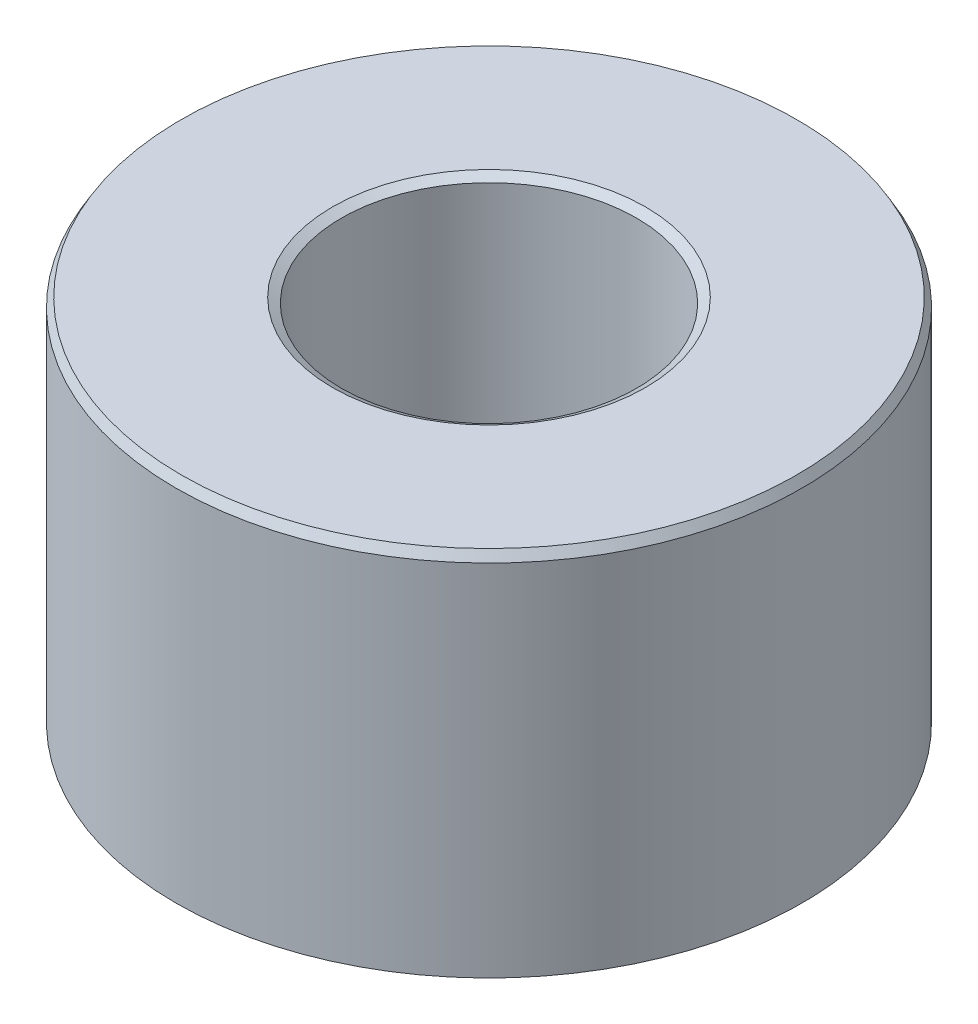
ISO-10303-21;
HEADER;
FILE_DESCRIPTION(('STEP AP214'),'2;1');
FILE_NAME('part.step','',(''),(''),'','','');
FILE_SCHEMA(('AUTOMOTIVE_DESIGN { 1 0 10303 214 1 1 1 1 }'));
ENDSEC;
DATA;
#1=APPLICATION_CONTEXT('core data for automotive mechanical design processes');
#2=APPLICATION_PROTOCOL_DEFINITION('international standard','automotive_design',2000,#1);
#3=PRODUCT_CONTEXT('',#1,'mechanical');
#4=PRODUCT('Part','Part','',(#3));
#5=PRODUCT_RELATED_PRODUCT_CATEGORY('part','',(#4));
#6=PRODUCT_DEFINITION_FORMATION('','',#4);
#7=PRODUCT_DEFINITION_CONTEXT('part definition',#1,'design');
#8=PRODUCT_DEFINITION('design','',#6,#7);
#9=PRODUCT_DEFINITION_SHAPE('','',#8);
#10=(LENGTH_UNIT() NAMED_UNIT(*) SI_UNIT(.MILLI.,.METRE.));
#11=(NAMED_UNIT(*) PLANE_ANGLE_UNIT() SI_UNIT($,.RADIAN.));
#12=(NAMED_UNIT(*) SI_UNIT($,.STERADIAN.) SOLID_ANGLE_UNIT());
#13=UNCERTAINTY_MEASURE_WITH_UNIT(LENGTH_MEASURE(1.E-05),#10,'distance_accuracy_value','');
#14=(GEOMETRIC_REPRESENTATION_CONTEXT(3) GLOBAL_UNCERTAINTY_ASSIGNED_CONTEXT((#13)) GLOBAL_UNIT_ASSIGNED_CONTEXT((#10,
#11,#12)) REPRESENTATION_CONTEXT('',''));
#15=CARTESIAN_POINT('',(0.,0.,0.));
#16=DIRECTION('',(0.,0.,1.));
#17=DIRECTION('',(1.,0.,0.));
#18=AXIS2_PLACEMENT_3D('',#15,#16,#17);
#19=CARTESIAN_POINT('',(0.,47.7332556404234,0.));
#20=DIRECTION('',(0.,-1.,0.));
#21=DIRECTION('',(0.,0.,-1.));
#22=AXIS2_PLACEMENT_3D('',#19,#20,#21);
#23=CYLINDRICAL_SURFACE('',#22,40.);
#24=CARTESIAN_POINT('',(0.,0.660036198186671,0.));
#25=DIRECTION('',(0.,1.,0.));
#26=DIRECTION('',(0.,0.,1.));
#27=AXIS2_PLACEMENT_3D('',#24,#25,#26);
#28=CIRCLE('',#27,40.);
#29=CARTESIAN_POINT('',(0.,0.660036198186671,40.));
#30=VERTEX_POINT('',#29);
#31=EDGE_CURVE('E10',#30,#30,#28,.T.);
#32=ORIENTED_EDGE('',*,*,#31,.T.);
#33=EDGE_LOOP('',(#32));
#34=FACE_BOUND('',#33,.T.);
#35=CARTESIAN_POINT('',(0.,46.5900394103295,0.));
#36=DIRECTION('',(0.,1.,0.));
#37=DIRECTION('',(0.,0.,1.));
#38=AXIS2_PLACEMENT_3D('',#35,#36,#37);
#39=CIRCLE('',#38,40.);
#40=CARTESIAN_POINT('',(0.,46.5900394103295,40.));
#41=VERTEX_POINT('',#40);
#42=EDGE_CURVE('E50',#41,#41,#39,.F.);
#43=ORIENTED_EDGE('',*,*,#42,.T.);
#44=EDGE_LOOP('',(#43));
#45=FACE_BOUND('',#44,.T.);
#46=ADVANCED_FACE('F39',(#34,#45),#23,.T.);
#47=CARTESIAN_POINT('',(0.,47.7332556404234,0.));
#48=DIRECTION('',(0.,1.,0.));
#49=DIRECTION('',(0.,0.,1.));
#50=AXIS2_PLACEMENT_3D('',#47,#48,#49);
#51=PLANE('',#50);
#52=CARTESIAN_POINT('',(0.,47.7332556404234,0.));
#53=DIRECTION('',(0.,1.,0.));
#54=DIRECTION('',(0.,0.,1.));
#55=AXIS2_PLACEMENT_3D('',#52,#53,#54);
#56=CIRCLE('',#55,20.00374684527);
#57=CARTESIAN_POINT('',(0.,47.7332556404234,20.00374684527));
#58=VERTEX_POINT('',#57);
#59=EDGE_CURVE('E58',#58,#58,#56,.F.);
#60=ORIENTED_EDGE('',*,*,#59,.T.);
#61=EDGE_LOOP('',(#60));
#62=FACE_BOUND('',#61,.T.);
#63=CARTESIAN_POINT('',(0.,47.7332556404234,0.));
#64=DIRECTION('',(0.,1.,0.));
#65=DIRECTION('',(0.,0.,1.));
#66=AXIS2_PLACEMENT_3D('',#63,#64,#65);
#67=CIRCLE('',#66,39.3399638018133);
#68=CARTESIAN_POINT('',(0.,47.7332556404234,39.3399638018133));
#69=VERTEX_POINT('',#68);
#70=EDGE_CURVE('E61',#69,#69,#67,.T.);
#71=ORIENTED_EDGE('',*,*,#70,.T.);
#72=EDGE_LOOP('',(#71));
#73=FACE_BOUND('',#72,.T.);
#74=ADVANCED_FACE('F88',(#62,#73),#51,.T.);
#75=CARTESIAN_POINT('',(0.,0.,0.));
#76=DIRECTION('',(0.,1.,0.));
#77=DIRECTION('',(0.,0.,1.));
#78=AXIS2_PLACEMENT_3D('',#75,#76,#77);
#79=PLANE('',#78);
#80=CARTESIAN_POINT('',(0.,0.,0.));
#81=DIRECTION('',(0.,1.,0.));
#82=DIRECTION('',(0.,0.,1.));
#83=AXIS2_PLACEMENT_3D('',#80,#81,#82);
#84=CIRCLE('',#83,19.5205668133627);
#85=CARTESIAN_POINT('',(0.,0.,19.5205668133627));
#86=VERTEX_POINT('',#85);
#87=EDGE_CURVE('E51',#86,#86,#84,.T.);
#88=ORIENTED_EDGE('',*,*,#87,.T.);
#89=EDGE_LOOP('',(#88));
#90=FACE_BOUND('',#89,.T.);
#91=CARTESIAN_POINT('',(0.,0.,0.));
#92=DIRECTION('',(0.,1.,0.));
#93=DIRECTION('',(0.,0.,1.));
#94=AXIS2_PLACEMENT_3D('',#91,#92,#93);
#95=CIRCLE('',#94,38.8567837699061);
#96=CARTESIAN_POINT('',(0.,0.,38.8567837699061));
#97=VERTEX_POINT('',#96);
#98=EDGE_CURVE('E54',#97,#97,#95,.F.);
#99=ORIENTED_EDGE('',*,*,#98,.T.);
#100=EDGE_LOOP('',(#99));
#101=FACE_BOUND('',#100,.T.);
#102=ADVANCED_FACE('F83',(#90,#101),#79,.F.);
#103=CARTESIAN_POINT('',(0.,47.7332556404234,0.));
#104=DIRECTION('',(0.,-1.,0.));
#105=DIRECTION('',(0.,0.,-1.));
#106=AXIS2_PLACEMENT_3D('',#103,#104,#105);
#107=CYLINDRICAL_SURFACE('',#106,18.8605306151761);
#108=CARTESIAN_POINT('',(0.,47.0732194422367,0.));
#109=DIRECTION('',(0.,1.,0.));
#110=DIRECTION('',(0.,0.,1.));
#111=AXIS2_PLACEMENT_3D('',#108,#109,#110);
#112=CIRCLE('',#111,18.8605306151761);
#113=CARTESIAN_POINT('',(0.,47.0732194422367,18.8605306151761));
#114=VERTEX_POINT('',#113);
#115=EDGE_CURVE('E67',#114,#114,#112,.T.);
#116=ORIENTED_EDGE('',*,*,#115,.T.);
#117=EDGE_LOOP('',(#116));
#118=FACE_BOUND('',#117,.T.);
#119=CARTESIAN_POINT('',(0.,1.14321623009394,0.));
#120=DIRECTION('',(0.,1.,0.));
#121=DIRECTION('',(0.,0.,1.));
#122=AXIS2_PLACEMENT_3D('',#119,#120,#121);
#123=CIRCLE('',#122,18.8605306151761);
#124=CARTESIAN_POINT('',(0.,1.14321623009394,18.8605306151761));
#125=VERTEX_POINT('',#124);
#126=EDGE_CURVE('E69',#125,#125,#123,.F.);
#127=ORIENTED_EDGE('',*,*,#126,.T.);
#128=EDGE_LOOP('',(#127));
#129=FACE_BOUND('',#128,.T.);
#130=ADVANCED_FACE('F71',(#118,#129),#107,.F.);
#131=CARTESIAN_POINT('',(0.,47.0732194422367,0.));
#132=DIRECTION('',(0.,1.,0.));
#133=DIRECTION('',(0.,0.,1.));
#134=AXIS2_PLACEMENT_3D('',#131,#132,#133);
#135=CONICAL_SURFACE('',#134,18.8605306151761,1.0471975511966);
#136=ORIENTED_EDGE('',*,*,#59,.F.);
#137=EDGE_LOOP('',(#136));
#138=FACE_BOUND('',#137,.T.);
#139=ORIENTED_EDGE('',*,*,#115,.F.);
#140=EDGE_LOOP('',(#139));
#141=FACE_BOUND('',#140,.T.);
#142=ADVANCED_FACE('F77',(#138,#141),#135,.F.);
#143=CARTESIAN_POINT('',(0.,0.,0.));
#144=DIRECTION('',(0.,-1.,0.));
#145=DIRECTION('',(0.,0.,-1.));
#146=AXIS2_PLACEMENT_3D('',#143,#144,#145);
#147=CONICAL_SURFACE('',#146,19.5205668133627,0.523598775598297);
#148=ORIENTED_EDGE('',*,*,#126,.F.);
#149=EDGE_LOOP('',(#148));
#150=FACE_BOUND('',#149,.T.);
#151=ORIENTED_EDGE('',*,*,#87,.F.);
#152=EDGE_LOOP('',(#151));
#153=FACE_BOUND('',#152,.T.);
#154=ADVANCED_FACE('F73',(#150,#153),#147,.F.);
#155=CARTESIAN_POINT('',(0.,0.660036198186671,0.));
#156=DIRECTION('',(0.,1.,0.));
#157=DIRECTION('',(0.,0.,1.));
#158=AXIS2_PLACEMENT_3D('',#155,#156,#157);
#159=CONICAL_SURFACE('',#158,40.,1.0471975511966);
#160=ORIENTED_EDGE('',*,*,#98,.F.);
#161=EDGE_LOOP('',(#160));
#162=FACE_BOUND('',#161,.T.);
#163=ORIENTED_EDGE('',*,*,#31,.F.);
#164=EDGE_LOOP('',(#163));
#165=FACE_BOUND('',#164,.T.);
#166=ADVANCED_FACE('F76',(#162,#165),#159,.T.);
#167=CARTESIAN_POINT('',(0.,47.7332556404234,0.));
#168=DIRECTION('',(0.,-1.,0.));
#169=DIRECTION('',(0.,0.,-1.));
#170=AXIS2_PLACEMENT_3D('',#167,#168,#169);
#171=CONICAL_SURFACE('',#170,39.3399638018133,0.523598775598297);
#172=ORIENTED_EDGE('',*,*,#42,.F.);
#173=EDGE_LOOP('',(#172));
#174=FACE_BOUND('',#173,.T.);
#175=ORIENTED_EDGE('',*,*,#70,.F.);
#176=EDGE_LOOP('',(#175));
#177=FACE_BOUND('',#176,.T.);
#178=ADVANCED_FACE('F45',(#174,#177),#171,.T.);
#179=CLOSED_SHELL('',(#46,#74,#102,#130,#142,#154,#166,#178));
#180=MANIFOLD_SOLID_BREP('B2',#179);
#181=ADVANCED_BREP_SHAPE_REPRESENTATION('',(#18,#180),#14);
#182=SHAPE_DEFINITION_REPRESENTATION(#9,#181);
ENDSEC;
END-ISO-10303-21;
